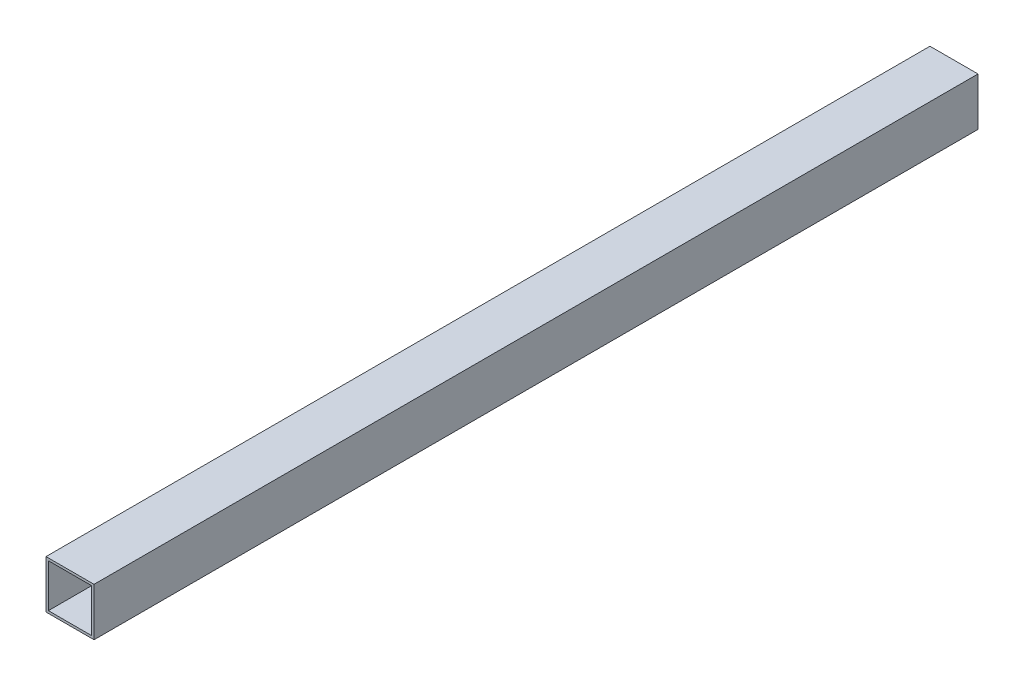
ISO-10303-21;
HEADER;
FILE_DESCRIPTION(('STEP AP214'),'2;1');
FILE_NAME('part.step','',(''),(''),'','','');
FILE_SCHEMA(('AUTOMOTIVE_DESIGN { 1 0 10303 214 1 1 1 1 }'));
ENDSEC;
DATA;
#1=APPLICATION_CONTEXT('core data for automotive mechanical design processes');
#2=APPLICATION_PROTOCOL_DEFINITION('international standard','automotive_design',2000,#1);
#3=PRODUCT_CONTEXT('',#1,'mechanical');
#4=PRODUCT('Part','Part','',(#3));
#5=PRODUCT_RELATED_PRODUCT_CATEGORY('part','',(#4));
#6=PRODUCT_DEFINITION_FORMATION('','',#4);
#7=PRODUCT_DEFINITION_CONTEXT('part definition',#1,'design');
#8=PRODUCT_DEFINITION('design','',#6,#7);
#9=PRODUCT_DEFINITION_SHAPE('','',#8);
#10=(LENGTH_UNIT() NAMED_UNIT(*) SI_UNIT(.MILLI.,.METRE.));
#11=(NAMED_UNIT(*) PLANE_ANGLE_UNIT() SI_UNIT($,.RADIAN.));
#12=(NAMED_UNIT(*) SI_UNIT($,.STERADIAN.) SOLID_ANGLE_UNIT());
#13=UNCERTAINTY_MEASURE_WITH_UNIT(LENGTH_MEASURE(1.E-05),#10,'distance_accuracy_value','');
#14=(GEOMETRIC_REPRESENTATION_CONTEXT(3) GLOBAL_UNCERTAINTY_ASSIGNED_CONTEXT((#13)) GLOBAL_UNIT_ASSIGNED_CONTEXT((#10,
#11,#12)) REPRESENTATION_CONTEXT('',''));
#15=CARTESIAN_POINT('',(0.,0.,0.));
#16=DIRECTION('',(0.,0.,1.));
#17=DIRECTION('',(1.,0.,0.));
#18=AXIS2_PLACEMENT_3D('',#15,#16,#17);
#19=CARTESIAN_POINT('',(0.,0.,920.));
#20=DIRECTION('',(0.,0.,-1.));
#21=DIRECTION('',(-1.,0.,0.));
#22=AXIS2_PLACEMENT_3D('',#19,#20,#21);
#23=PLANE('',#22);
#24=DIRECTION('',(0.,-1.,0.));
#25=VECTOR('',#24,1.);
#26=CARTESIAN_POINT('',(-50.,-50.,920.));
#27=LINE('',#26,#25);
#28=CARTESIAN_POINT('',(-50.,49.9999999999999,920.));
#29=VERTEX_POINT('',#28);
#30=CARTESIAN_POINT('',(-50.,-50.,920.));
#31=VERTEX_POINT('',#30);
#32=EDGE_CURVE('E134',#29,#31,#27,.T.);
#33=ORIENTED_EDGE('',*,*,#32,.T.);
#34=DIRECTION('',(1.,0.,0.));
#35=VECTOR('',#34,1.);
#36=CARTESIAN_POINT('',(-50.,-50.,920.));
#37=LINE('',#36,#35);
#38=CARTESIAN_POINT('',(50.,-50.,920.));
#39=VERTEX_POINT('',#38);
#40=EDGE_CURVE('E137',#31,#39,#37,.T.);
#41=ORIENTED_EDGE('',*,*,#40,.T.);
#42=DIRECTION('',(0.,1.,0.));
#43=VECTOR('',#42,1.);
#44=CARTESIAN_POINT('',(50.,-50.,920.));
#45=LINE('',#44,#43);
#46=CARTESIAN_POINT('',(49.9999999999999,49.9999999999999,920.));
#47=VERTEX_POINT('',#46);
#48=EDGE_CURVE('E140',#39,#47,#45,.T.);
#49=ORIENTED_EDGE('',*,*,#48,.T.);
#50=DIRECTION('',(-1.,0.,0.));
#51=VECTOR('',#50,1.);
#52=CARTESIAN_POINT('',(-50.,49.9999999999999,920.));
#53=LINE('',#52,#51);
#54=EDGE_CURVE('E142',#47,#29,#53,.T.);
#55=ORIENTED_EDGE('',*,*,#54,.T.);
#56=EDGE_LOOP('',(#33,#41,#49,#55));
#57=FACE_BOUND('',#56,.T.);
#58=DIRECTION('',(0.,-1.,0.));
#59=VECTOR('',#58,1.);
#60=CARTESIAN_POINT('',(-45.,-45.,920.));
#61=LINE('',#60,#59);
#62=CARTESIAN_POINT('',(-45.,44.9999999999999,920.));
#63=VERTEX_POINT('',#62);
#64=CARTESIAN_POINT('',(-45.,-45.,920.));
#65=VERTEX_POINT('',#64);
#66=EDGE_CURVE('E98',#63,#65,#61,.T.);
#67=ORIENTED_EDGE('',*,*,#66,.F.);
#68=DIRECTION('',(-1.,0.,0.));
#69=VECTOR('',#68,1.);
#70=CARTESIAN_POINT('',(-45.,44.9999999999999,920.));
#71=LINE('',#70,#69);
#72=CARTESIAN_POINT('',(45.,44.9999999999999,920.));
#73=VERTEX_POINT('',#72);
#74=EDGE_CURVE('E120',#73,#63,#71,.T.);
#75=ORIENTED_EDGE('',*,*,#74,.F.);
#76=DIRECTION('',(0.,1.,0.));
#77=VECTOR('',#76,1.);
#78=CARTESIAN_POINT('',(45.,-45.,920.));
#79=LINE('',#78,#77);
#80=CARTESIAN_POINT('',(45.,-45.,920.));
#81=VERTEX_POINT('',#80);
#82=EDGE_CURVE('E118',#81,#73,#79,.T.);
#83=ORIENTED_EDGE('',*,*,#82,.F.);
#84=DIRECTION('',(1.,0.,0.));
#85=VECTOR('',#84,1.);
#86=CARTESIAN_POINT('',(-45.,-45.,920.));
#87=LINE('',#86,#85);
#88=EDGE_CURVE('E106',#65,#81,#87,.T.);
#89=ORIENTED_EDGE('',*,*,#88,.F.);
#90=EDGE_LOOP('',(#67,#75,#83,#89));
#91=FACE_BOUND('',#90,.T.);
#92=ADVANCED_FACE('F33',(#57,#91),#23,.F.);
#93=CARTESIAN_POINT('',(0.,0.,-920.));
#94=DIRECTION('',(0.,0.,-1.));
#95=DIRECTION('',(-1.,0.,0.));
#96=AXIS2_PLACEMENT_3D('',#93,#94,#95);
#97=PLANE('',#96);
#98=DIRECTION('',(0.,-1.,0.));
#99=VECTOR('',#98,1.);
#100=CARTESIAN_POINT('',(-50.,-50.,-920.));
#101=LINE('',#100,#99);
#102=CARTESIAN_POINT('',(-50.,49.9999999999999,-920.));
#103=VERTEX_POINT('',#102);
#104=CARTESIAN_POINT('',(-50.,-50.,-920.));
#105=VERTEX_POINT('',#104);
#106=EDGE_CURVE('E114',#103,#105,#101,.T.);
#107=ORIENTED_EDGE('',*,*,#106,.F.);
#108=DIRECTION('',(-1.,0.,0.));
#109=VECTOR('',#108,1.);
#110=CARTESIAN_POINT('',(-50.,49.9999999999999,-920.));
#111=LINE('',#110,#109);
#112=CARTESIAN_POINT('',(49.9999999999999,49.9999999999999,-920.));
#113=VERTEX_POINT('',#112);
#114=EDGE_CURVE('E138',#113,#103,#111,.T.);
#115=ORIENTED_EDGE('',*,*,#114,.F.);
#116=DIRECTION('',(0.,1.,0.));
#117=VECTOR('',#116,1.);
#118=CARTESIAN_POINT('',(50.,-50.,-920.));
#119=LINE('',#118,#117);
#120=CARTESIAN_POINT('',(50.,-50.,-920.));
#121=VERTEX_POINT('',#120);
#122=EDGE_CURVE('E149',#121,#113,#119,.T.);
#123=ORIENTED_EDGE('',*,*,#122,.F.);
#124=DIRECTION('',(1.,0.,0.));
#125=VECTOR('',#124,1.);
#126=CARTESIAN_POINT('',(-50.,-50.,-920.));
#127=LINE('',#126,#125);
#128=EDGE_CURVE('E147',#105,#121,#127,.T.);
#129=ORIENTED_EDGE('',*,*,#128,.F.);
#130=EDGE_LOOP('',(#107,#115,#123,#129));
#131=FACE_BOUND('',#130,.T.);
#132=DIRECTION('',(-1.,0.,0.));
#133=VECTOR('',#132,1.);
#134=CARTESIAN_POINT('',(-45.,44.9999999999999,-920.));
#135=LINE('',#134,#133);
#136=CARTESIAN_POINT('',(45.,44.9999999999999,-920.));
#137=VERTEX_POINT('',#136);
#138=CARTESIAN_POINT('',(-45.,44.9999999999999,-920.));
#139=VERTEX_POINT('',#138);
#140=EDGE_CURVE('E107',#137,#139,#135,.T.);
#141=ORIENTED_EDGE('',*,*,#140,.T.);
#142=DIRECTION('',(0.,-1.,0.));
#143=VECTOR('',#142,1.);
#144=CARTESIAN_POINT('',(-45.,-45.,-920.));
#145=LINE('',#144,#143);
#146=CARTESIAN_POINT('',(-45.,-45.,-920.));
#147=VERTEX_POINT('',#146);
#148=EDGE_CURVE('E56',#139,#147,#145,.T.);
#149=ORIENTED_EDGE('',*,*,#148,.T.);
#150=DIRECTION('',(1.,0.,0.));
#151=VECTOR('',#150,1.);
#152=CARTESIAN_POINT('',(-45.,-45.,-920.));
#153=LINE('',#152,#151);
#154=CARTESIAN_POINT('',(45.,-45.,-920.));
#155=VERTEX_POINT('',#154);
#156=EDGE_CURVE('E113',#147,#155,#153,.T.);
#157=ORIENTED_EDGE('',*,*,#156,.T.);
#158=DIRECTION('',(0.,1.,0.));
#159=VECTOR('',#158,1.);
#160=CARTESIAN_POINT('',(45.,-45.,-920.));
#161=LINE('',#160,#159);
#162=EDGE_CURVE('E126',#155,#137,#161,.T.);
#163=ORIENTED_EDGE('',*,*,#162,.T.);
#164=EDGE_LOOP('',(#141,#149,#157,#163));
#165=FACE_BOUND('',#164,.T.);
#166=ADVANCED_FACE('F167',(#131,#165),#97,.T.);
#167=CARTESIAN_POINT('',(-50.,-50.,920.));
#168=DIRECTION('',(1.,0.,0.));
#169=DIRECTION('',(0.,0.,-1.));
#170=AXIS2_PLACEMENT_3D('',#167,#168,#169);
#171=PLANE('',#170);
#172=ORIENTED_EDGE('',*,*,#106,.T.);
#173=DIRECTION('',(0.,0.,-1.));
#174=VECTOR('',#173,1.);
#175=CARTESIAN_POINT('',(-50.,-50.,920.));
#176=LINE('',#175,#174);
#177=EDGE_CURVE('E11',#31,#105,#176,.T.);
#178=ORIENTED_EDGE('',*,*,#177,.F.);
#179=ORIENTED_EDGE('',*,*,#32,.F.);
#180=DIRECTION('',(0.,0.,-1.));
#181=VECTOR('',#180,1.);
#182=CARTESIAN_POINT('',(-50.,49.9999999999999,920.));
#183=LINE('',#182,#181);
#184=EDGE_CURVE('E144',#29,#103,#183,.T.);
#185=ORIENTED_EDGE('',*,*,#184,.T.);
#186=EDGE_LOOP('',(#172,#178,#179,#185));
#187=FACE_BOUND('',#186,.T.);
#188=ADVANCED_FACE('F35',(#187),#171,.F.);
#189=CARTESIAN_POINT('',(-50.,-50.,920.));
#190=DIRECTION('',(0.,1.,0.));
#191=DIRECTION('',(0.,0.,1.));
#192=AXIS2_PLACEMENT_3D('',#189,#190,#191);
#193=PLANE('',#192);
#194=ORIENTED_EDGE('',*,*,#128,.T.);
#195=DIRECTION('',(0.,0.,-1.));
#196=VECTOR('',#195,1.);
#197=CARTESIAN_POINT('',(50.,-50.,920.));
#198=LINE('',#197,#196);
#199=EDGE_CURVE('E41',#39,#121,#198,.T.);
#200=ORIENTED_EDGE('',*,*,#199,.F.);
#201=ORIENTED_EDGE('',*,*,#40,.F.);
#202=ORIENTED_EDGE('',*,*,#177,.T.);
#203=EDGE_LOOP('',(#194,#200,#201,#202));
#204=FACE_BOUND('',#203,.T.);
#205=ADVANCED_FACE('F177',(#204),#193,.F.);
#206=CARTESIAN_POINT('',(50.,-50.,920.));
#207=DIRECTION('',(-1.,0.,0.));
#208=DIRECTION('',(0.,-1.,0.));
#209=AXIS2_PLACEMENT_3D('',#206,#207,#208);
#210=PLANE('',#209);
#211=ORIENTED_EDGE('',*,*,#122,.T.);
#212=DIRECTION('',(0.,0.,-1.));
#213=VECTOR('',#212,1.);
#214=CARTESIAN_POINT('',(49.9999999999999,49.9999999999999,920.));
#215=LINE('',#214,#213);
#216=EDGE_CURVE('E154',#47,#113,#215,.T.);
#217=ORIENTED_EDGE('',*,*,#216,.F.);
#218=ORIENTED_EDGE('',*,*,#48,.F.);
#219=ORIENTED_EDGE('',*,*,#199,.T.);
#220=EDGE_LOOP('',(#211,#217,#218,#219));
#221=FACE_BOUND('',#220,.T.);
#222=ADVANCED_FACE('F161',(#221),#210,.F.);
#223=CARTESIAN_POINT('',(-50.,49.9999999999999,920.));
#224=DIRECTION('',(0.,-1.,0.));
#225=DIRECTION('',(0.,0.,-1.));
#226=AXIS2_PLACEMENT_3D('',#223,#224,#225);
#227=PLANE('',#226);
#228=ORIENTED_EDGE('',*,*,#114,.T.);
#229=ORIENTED_EDGE('',*,*,#184,.F.);
#230=ORIENTED_EDGE('',*,*,#54,.F.);
#231=ORIENTED_EDGE('',*,*,#216,.T.);
#232=EDGE_LOOP('',(#228,#229,#230,#231));
#233=FACE_BOUND('',#232,.T.);
#234=ADVANCED_FACE('F171',(#233),#227,.F.);
#235=CARTESIAN_POINT('',(-45.,-45.,920.));
#236=DIRECTION('',(1.,0.,0.));
#237=DIRECTION('',(0.,0.,-1.));
#238=AXIS2_PLACEMENT_3D('',#235,#236,#237);
#239=PLANE('',#238);
#240=ORIENTED_EDGE('',*,*,#148,.F.);
#241=DIRECTION('',(0.,0.,-1.));
#242=VECTOR('',#241,1.);
#243=CARTESIAN_POINT('',(-45.,44.9999999999999,920.));
#244=LINE('',#243,#242);
#245=EDGE_CURVE('E102',#63,#139,#244,.T.);
#246=ORIENTED_EDGE('',*,*,#245,.F.);
#247=ORIENTED_EDGE('',*,*,#66,.T.);
#248=DIRECTION('',(0.,0.,-1.));
#249=VECTOR('',#248,1.);
#250=CARTESIAN_POINT('',(-45.,-45.,920.));
#251=LINE('',#250,#249);
#252=EDGE_CURVE('E101',#65,#147,#251,.T.);
#253=ORIENTED_EDGE('',*,*,#252,.T.);
#254=EDGE_LOOP('',(#240,#246,#247,#253));
#255=FACE_BOUND('',#254,.T.);
#256=ADVANCED_FACE('F100',(#255),#239,.T.);
#257=CARTESIAN_POINT('',(-45.,-45.,920.));
#258=DIRECTION('',(0.,1.,0.));
#259=DIRECTION('',(0.,0.,1.));
#260=AXIS2_PLACEMENT_3D('',#257,#258,#259);
#261=PLANE('',#260);
#262=ORIENTED_EDGE('',*,*,#156,.F.);
#263=ORIENTED_EDGE('',*,*,#252,.F.);
#264=ORIENTED_EDGE('',*,*,#88,.T.);
#265=DIRECTION('',(0.,0.,-1.));
#266=VECTOR('',#265,1.);
#267=CARTESIAN_POINT('',(45.,-45.,920.));
#268=LINE('',#267,#266);
#269=EDGE_CURVE('E115',#81,#155,#268,.T.);
#270=ORIENTED_EDGE('',*,*,#269,.T.);
#271=EDGE_LOOP('',(#262,#263,#264,#270));
#272=FACE_BOUND('',#271,.T.);
#273=ADVANCED_FACE('F110',(#272),#261,.T.);
#274=CARTESIAN_POINT('',(45.,-45.,920.));
#275=DIRECTION('',(-1.,0.,0.));
#276=DIRECTION('',(0.,-1.,0.));
#277=AXIS2_PLACEMENT_3D('',#274,#275,#276);
#278=PLANE('',#277);
#279=ORIENTED_EDGE('',*,*,#162,.F.);
#280=ORIENTED_EDGE('',*,*,#269,.F.);
#281=ORIENTED_EDGE('',*,*,#82,.T.);
#282=DIRECTION('',(0.,0.,-1.));
#283=VECTOR('',#282,1.);
#284=CARTESIAN_POINT('',(45.,44.9999999999999,920.));
#285=LINE('',#284,#283);
#286=EDGE_CURVE('E48',#73,#137,#285,.T.);
#287=ORIENTED_EDGE('',*,*,#286,.T.);
#288=EDGE_LOOP('',(#279,#280,#281,#287));
#289=FACE_BOUND('',#288,.T.);
#290=ADVANCED_FACE('F200',(#289),#278,.T.);
#291=CARTESIAN_POINT('',(-45.,44.9999999999999,920.));
#292=DIRECTION('',(0.,-1.,0.));
#293=DIRECTION('',(0.,0.,-1.));
#294=AXIS2_PLACEMENT_3D('',#291,#292,#293);
#295=PLANE('',#294);
#296=ORIENTED_EDGE('',*,*,#140,.F.);
#297=ORIENTED_EDGE('',*,*,#286,.F.);
#298=ORIENTED_EDGE('',*,*,#74,.T.);
#299=ORIENTED_EDGE('',*,*,#245,.T.);
#300=EDGE_LOOP('',(#296,#297,#298,#299));
#301=FACE_BOUND('',#300,.T.);
#302=ADVANCED_FACE('F204',(#301),#295,.T.);
#303=CLOSED_SHELL('',(#92,#166,#188,#205,#222,#234,#256,#273,#290,#302));
#304=MANIFOLD_SOLID_BREP('B2',#303);
#305=ADVANCED_BREP_SHAPE_REPRESENTATION('',(#18,#304),#14);
#306=SHAPE_DEFINITION_REPRESENTATION(#9,#305);
ENDSEC;
END-ISO-10303-21;
